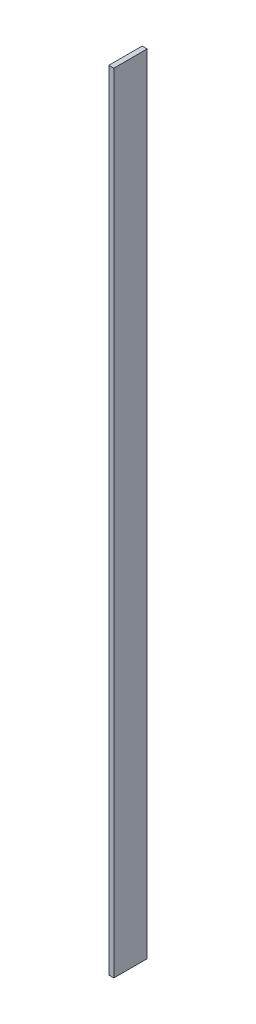
ISO-10303-21;
HEADER;
FILE_DESCRIPTION(('STEP AP214'),'2;1');
FILE_NAME('part.step','',(''),(''),'','','');
FILE_SCHEMA(('AUTOMOTIVE_DESIGN { 1 0 10303 214 1 1 1 1 }'));
ENDSEC;
DATA;
#1=APPLICATION_CONTEXT('core data for automotive mechanical design processes');
#2=APPLICATION_PROTOCOL_DEFINITION('international standard','automotive_design',2000,#1);
#3=PRODUCT_CONTEXT('',#1,'mechanical');
#4=PRODUCT('Part','Part','',(#3));
#5=PRODUCT_RELATED_PRODUCT_CATEGORY('part','',(#4));
#6=PRODUCT_DEFINITION_FORMATION('','',#4);
#7=PRODUCT_DEFINITION_CONTEXT('part definition',#1,'design');
#8=PRODUCT_DEFINITION('design','',#6,#7);
#9=PRODUCT_DEFINITION_SHAPE('','',#8);
#10=(LENGTH_UNIT() NAMED_UNIT(*) SI_UNIT(.MILLI.,.METRE.));
#11=(NAMED_UNIT(*) PLANE_ANGLE_UNIT() SI_UNIT($,.RADIAN.));
#12=(NAMED_UNIT(*) SI_UNIT($,.STERADIAN.) SOLID_ANGLE_UNIT());
#13=UNCERTAINTY_MEASURE_WITH_UNIT(LENGTH_MEASURE(1.E-05),#10,'distance_accuracy_value','');
#14=(GEOMETRIC_REPRESENTATION_CONTEXT(3) GLOBAL_UNCERTAINTY_ASSIGNED_CONTEXT((#13)) GLOBAL_UNIT_ASSIGNED_CONTEXT((#10,
#11,#12)) REPRESENTATION_CONTEXT('',''));
#15=CARTESIAN_POINT('',(0.,0.,0.));
#16=DIRECTION('',(0.,0.,1.));
#17=DIRECTION('',(1.,0.,0.));
#18=AXIS2_PLACEMENT_3D('',#15,#16,#17);
#19=CARTESIAN_POINT('',(2.38125,0.,0.));
#20=DIRECTION('',(0.,0.,-1.));
#21=DIRECTION('',(-1.,0.,0.));
#22=AXIS2_PLACEMENT_3D('',#19,#20,#21);
#23=PLANE('',#22);
#24=DIRECTION('',(0.,-1.,0.));
#25=VECTOR('',#24,1.);
#26=CARTESIAN_POINT('',(0.,0.,0.));
#27=LINE('',#26,#25);
#28=CARTESIAN_POINT('',(0.,374.65,0.));
#29=VERTEX_POINT('',#28);
#30=CARTESIAN_POINT('',(0.,0.,0.));
#31=VERTEX_POINT('',#30);
#32=EDGE_CURVE('E97',#29,#31,#27,.T.);
#33=ORIENTED_EDGE('',*,*,#32,.T.);
#34=DIRECTION('',(-1.,0.,0.));
#35=VECTOR('',#34,1.);
#36=CARTESIAN_POINT('',(2.38125,0.,0.));
#37=LINE('',#36,#35);
#38=CARTESIAN_POINT('',(2.38125,0.,0.));
#39=VERTEX_POINT('',#38);
#40=EDGE_CURVE('E11',#39,#31,#37,.T.);
#41=ORIENTED_EDGE('',*,*,#40,.F.);
#42=DIRECTION('',(0.,-1.,0.));
#43=VECTOR('',#42,1.);
#44=CARTESIAN_POINT('',(2.38125,0.,0.));
#45=LINE('',#44,#43);
#46=CARTESIAN_POINT('',(2.38125,374.65,0.));
#47=VERTEX_POINT('',#46);
#48=EDGE_CURVE('E85',#47,#39,#45,.T.);
#49=ORIENTED_EDGE('',*,*,#48,.F.);
#50=DIRECTION('',(-1.,0.,0.));
#51=VECTOR('',#50,1.);
#52=CARTESIAN_POINT('',(2.38125,374.65,0.));
#53=LINE('',#52,#51);
#54=EDGE_CURVE('E93',#47,#29,#53,.T.);
#55=ORIENTED_EDGE('',*,*,#54,.T.);
#56=EDGE_LOOP('',(#33,#41,#49,#55));
#57=FACE_BOUND('',#56,.T.);
#58=ADVANCED_FACE('F34',(#57),#23,.F.);
#59=CARTESIAN_POINT('',(2.38125,0.,0.));
#60=DIRECTION('',(0.,1.,0.));
#61=DIRECTION('',(0.,0.,1.));
#62=AXIS2_PLACEMENT_3D('',#59,#60,#61);
#63=PLANE('',#62);
#64=DIRECTION('',(0.,0.,-1.));
#65=VECTOR('',#64,1.);
#66=CARTESIAN_POINT('',(0.,0.,0.));
#67=LINE('',#66,#65);
#68=CARTESIAN_POINT('',(0.,0.,-15.875));
#69=VERTEX_POINT('',#68);
#70=EDGE_CURVE('E89',#31,#69,#67,.T.);
#71=ORIENTED_EDGE('',*,*,#70,.T.);
#72=DIRECTION('',(-1.,0.,0.));
#73=VECTOR('',#72,1.);
#74=CARTESIAN_POINT('',(2.38125,0.,-15.875));
#75=LINE('',#74,#73);
#76=CARTESIAN_POINT('',(2.38125,0.,-15.875));
#77=VERTEX_POINT('',#76);
#78=EDGE_CURVE('E42',#77,#69,#75,.T.);
#79=ORIENTED_EDGE('',*,*,#78,.F.);
#80=DIRECTION('',(0.,0.,-1.));
#81=VECTOR('',#80,1.);
#82=CARTESIAN_POINT('',(2.38125,0.,0.));
#83=LINE('',#82,#81);
#84=EDGE_CURVE('E80',#39,#77,#83,.T.);
#85=ORIENTED_EDGE('',*,*,#84,.F.);
#86=ORIENTED_EDGE('',*,*,#40,.T.);
#87=EDGE_LOOP('',(#71,#79,#85,#86));
#88=FACE_BOUND('',#87,.T.);
#89=ADVANCED_FACE('F88',(#88),#63,.F.);
#90=CARTESIAN_POINT('',(2.38125,0.,-15.875));
#91=DIRECTION('',(0.,0.,1.));
#92=DIRECTION('',(1.,0.,0.));
#93=AXIS2_PLACEMENT_3D('',#90,#91,#92);
#94=PLANE('',#93);
#95=DIRECTION('',(0.,1.,0.));
#96=VECTOR('',#95,1.);
#97=CARTESIAN_POINT('',(0.,0.,-15.875));
#98=LINE('',#97,#96);
#99=CARTESIAN_POINT('',(0.,374.65,-15.875));
#100=VERTEX_POINT('',#99);
#101=EDGE_CURVE('E67',#69,#100,#98,.T.);
#102=ORIENTED_EDGE('',*,*,#101,.T.);
#103=DIRECTION('',(-1.,0.,0.));
#104=VECTOR('',#103,1.);
#105=CARTESIAN_POINT('',(2.38125,374.65,-15.875));
#106=LINE('',#105,#104);
#107=CARTESIAN_POINT('',(2.38125,374.65,-15.875));
#108=VERTEX_POINT('',#107);
#109=EDGE_CURVE('E90',#108,#100,#106,.T.);
#110=ORIENTED_EDGE('',*,*,#109,.F.);
#111=DIRECTION('',(0.,1.,0.));
#112=VECTOR('',#111,1.);
#113=CARTESIAN_POINT('',(2.38125,0.,-15.875));
#114=LINE('',#113,#112);
#115=EDGE_CURVE('E83',#77,#108,#114,.T.);
#116=ORIENTED_EDGE('',*,*,#115,.F.);
#117=ORIENTED_EDGE('',*,*,#78,.T.);
#118=EDGE_LOOP('',(#102,#110,#116,#117));
#119=FACE_BOUND('',#118,.T.);
#120=ADVANCED_FACE('F91',(#119),#94,.F.);
#121=CARTESIAN_POINT('',(2.38125,374.65,0.));
#122=DIRECTION('',(0.,-1.,0.));
#123=DIRECTION('',(0.,0.,-1.));
#124=AXIS2_PLACEMENT_3D('',#121,#122,#123);
#125=PLANE('',#124);
#126=DIRECTION('',(0.,0.,1.));
#127=VECTOR('',#126,1.);
#128=CARTESIAN_POINT('',(0.,374.65,0.));
#129=LINE('',#128,#127);
#130=EDGE_CURVE('E73',#100,#29,#129,.T.);
#131=ORIENTED_EDGE('',*,*,#130,.T.);
#132=ORIENTED_EDGE('',*,*,#54,.F.);
#133=DIRECTION('',(0.,0.,1.));
#134=VECTOR('',#133,1.);
#135=CARTESIAN_POINT('',(2.38125,374.65,0.));
#136=LINE('',#135,#134);
#137=EDGE_CURVE('E50',#108,#47,#136,.T.);
#138=ORIENTED_EDGE('',*,*,#137,.F.);
#139=ORIENTED_EDGE('',*,*,#109,.T.);
#140=EDGE_LOOP('',(#131,#132,#138,#139));
#141=FACE_BOUND('',#140,.T.);
#142=ADVANCED_FACE('F104',(#141),#125,.F.);
#143=CARTESIAN_POINT('',(2.38125,0.,0.));
#144=DIRECTION('',(-1.,0.,0.));
#145=DIRECTION('',(0.,0.,1.));
#146=AXIS2_PLACEMENT_3D('',#143,#144,#145);
#147=PLANE('',#146);
#148=ORIENTED_EDGE('',*,*,#48,.T.);
#149=ORIENTED_EDGE('',*,*,#84,.T.);
#150=ORIENTED_EDGE('',*,*,#115,.T.);
#151=ORIENTED_EDGE('',*,*,#137,.T.);
#152=EDGE_LOOP('',(#148,#149,#150,#151));
#153=FACE_BOUND('',#152,.T.);
#154=ADVANCED_FACE('F81',(#153),#147,.F.);
#155=CARTESIAN_POINT('',(0.,0.,0.));
#156=DIRECTION('',(-1.,0.,0.));
#157=DIRECTION('',(0.,0.,1.));
#158=AXIS2_PLACEMENT_3D('',#155,#156,#157);
#159=PLANE('',#158);
#160=ORIENTED_EDGE('',*,*,#32,.F.);
#161=ORIENTED_EDGE('',*,*,#130,.F.);
#162=ORIENTED_EDGE('',*,*,#101,.F.);
#163=ORIENTED_EDGE('',*,*,#70,.F.);
#164=EDGE_LOOP('',(#160,#161,#162,#163));
#165=FACE_BOUND('',#164,.T.);
#166=ADVANCED_FACE('F107',(#165),#159,.T.);
#167=CLOSED_SHELL('',(#58,#89,#120,#142,#154,#166));
#168=MANIFOLD_SOLID_BREP('B2',#167);
#169=ADVANCED_BREP_SHAPE_REPRESENTATION('',(#18,#168),#14);
#170=SHAPE_DEFINITION_REPRESENTATION(#9,#169);
ENDSEC;
END-ISO-10303-21;
